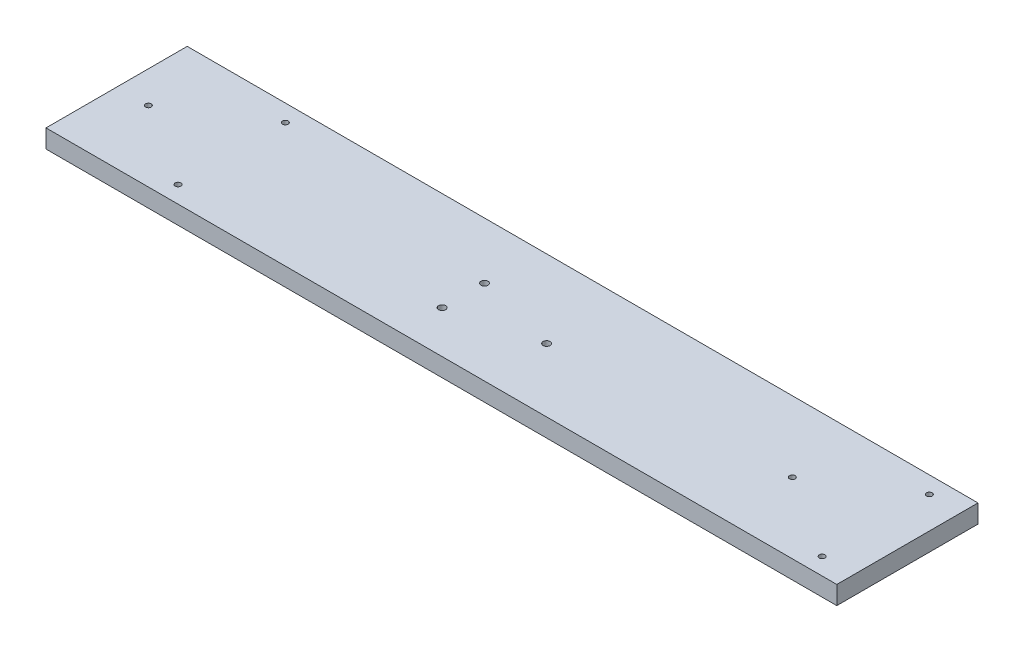
ISO-10303-21;
HEADER;
FILE_DESCRIPTION(('STEP AP214'),'2;1');
FILE_NAME('part.step','',(''),(''),'','','');
FILE_SCHEMA(('AUTOMOTIVE_DESIGN { 1 0 10303 214 1 1 1 1 }'));
ENDSEC;
DATA;
#1=APPLICATION_CONTEXT('core data for automotive mechanical design processes');
#2=APPLICATION_PROTOCOL_DEFINITION('international standard','automotive_design',2000,#1);
#3=PRODUCT_CONTEXT('',#1,'mechanical');
#4=PRODUCT('Part','Part','',(#3));
#5=PRODUCT_RELATED_PRODUCT_CATEGORY('part','',(#4));
#6=PRODUCT_DEFINITION_FORMATION('','',#4);
#7=PRODUCT_DEFINITION_CONTEXT('part definition',#1,'design');
#8=PRODUCT_DEFINITION('design','',#6,#7);
#9=PRODUCT_DEFINITION_SHAPE('','',#8);
#10=(LENGTH_UNIT() NAMED_UNIT(*) SI_UNIT(.MILLI.,.METRE.));
#11=(NAMED_UNIT(*) PLANE_ANGLE_UNIT() SI_UNIT($,.RADIAN.));
#12=(NAMED_UNIT(*) SI_UNIT($,.STERADIAN.) SOLID_ANGLE_UNIT());
#13=UNCERTAINTY_MEASURE_WITH_UNIT(LENGTH_MEASURE(1.E-05),#10,'distance_accuracy_value','');
#14=(GEOMETRIC_REPRESENTATION_CONTEXT(3) GLOBAL_UNCERTAINTY_ASSIGNED_CONTEXT((#13)) GLOBAL_UNIT_ASSIGNED_CONTEXT((#10,
#11,#12)) REPRESENTATION_CONTEXT('',''));
#15=CARTESIAN_POINT('',(0.,0.,0.));
#16=DIRECTION('',(0.,0.,1.));
#17=DIRECTION('',(1.,0.,0.));
#18=AXIS2_PLACEMENT_3D('',#15,#16,#17);
#19=CARTESIAN_POINT('',(0.,6.5,0.));
#20=DIRECTION('',(1.,0.,0.));
#21=DIRECTION('',(0.,0.,-1.));
#22=AXIS2_PLACEMENT_3D('',#19,#20,#21);
#23=PLANE('',#22);
#24=DIRECTION('',(0.,0.,1.));
#25=VECTOR('',#24,1.);
#26=CARTESIAN_POINT('',(0.,0.,0.));
#27=LINE('',#26,#25);
#28=CARTESIAN_POINT('',(0.,0.,-50.));
#29=VERTEX_POINT('',#28);
#30=CARTESIAN_POINT('',(0.,0.,0.));
#31=VERTEX_POINT('',#30);
#32=EDGE_CURVE('E96',#29,#31,#27,.T.);
#33=ORIENTED_EDGE('',*,*,#32,.T.);
#34=DIRECTION('',(0.,-1.,0.));
#35=VECTOR('',#34,1.);
#36=CARTESIAN_POINT('',(0.,6.5,0.));
#37=LINE('',#36,#35);
#38=CARTESIAN_POINT('',(0.,6.5,0.));
#39=VERTEX_POINT('',#38);
#40=EDGE_CURVE('E11',#39,#31,#37,.T.);
#41=ORIENTED_EDGE('',*,*,#40,.F.);
#42=DIRECTION('',(0.,0.,1.));
#43=VECTOR('',#42,1.);
#44=CARTESIAN_POINT('',(0.,6.5,0.));
#45=LINE('',#44,#43);
#46=CARTESIAN_POINT('',(0.,6.5,-50.));
#47=VERTEX_POINT('',#46);
#48=EDGE_CURVE('E84',#47,#39,#45,.T.);
#49=ORIENTED_EDGE('',*,*,#48,.F.);
#50=DIRECTION('',(0.,-1.,0.));
#51=VECTOR('',#50,1.);
#52=CARTESIAN_POINT('',(0.,6.5,-50.));
#53=LINE('',#52,#51);
#54=EDGE_CURVE('E92',#47,#29,#53,.T.);
#55=ORIENTED_EDGE('',*,*,#54,.T.);
#56=EDGE_LOOP('',(#33,#41,#49,#55));
#57=FACE_BOUND('',#56,.T.);
#58=ADVANCED_FACE('F33',(#57),#23,.F.);
#59=CARTESIAN_POINT('',(0.,6.5,0.));
#60=DIRECTION('',(0.,0.,-1.));
#61=DIRECTION('',(-1.,0.,0.));
#62=AXIS2_PLACEMENT_3D('',#59,#60,#61);
#63=PLANE('',#62);
#64=DIRECTION('',(1.,0.,0.));
#65=VECTOR('',#64,1.);
#66=CARTESIAN_POINT('',(0.,0.,0.));
#67=LINE('',#66,#65);
#68=CARTESIAN_POINT('',(280.,0.,0.));
#69=VERTEX_POINT('',#68);
#70=EDGE_CURVE('E88',#31,#69,#67,.T.);
#71=ORIENTED_EDGE('',*,*,#70,.T.);
#72=DIRECTION('',(0.,-1.,0.));
#73=VECTOR('',#72,1.);
#74=CARTESIAN_POINT('',(280.,6.5,0.));
#75=LINE('',#74,#73);
#76=CARTESIAN_POINT('',(280.,6.5,0.));
#77=VERTEX_POINT('',#76);
#78=EDGE_CURVE('E41',#77,#69,#75,.T.);
#79=ORIENTED_EDGE('',*,*,#78,.F.);
#80=DIRECTION('',(1.,0.,0.));
#81=VECTOR('',#80,1.);
#82=CARTESIAN_POINT('',(0.,6.5,0.));
#83=LINE('',#82,#81);
#84=EDGE_CURVE('E79',#39,#77,#83,.T.);
#85=ORIENTED_EDGE('',*,*,#84,.F.);
#86=ORIENTED_EDGE('',*,*,#40,.T.);
#87=EDGE_LOOP('',(#71,#79,#85,#86));
#88=FACE_BOUND('',#87,.T.);
#89=ADVANCED_FACE('F87',(#88),#63,.F.);
#90=CARTESIAN_POINT('',(280.,6.5,0.));
#91=DIRECTION('',(-1.,0.,0.));
#92=DIRECTION('',(0.,0.,1.));
#93=AXIS2_PLACEMENT_3D('',#90,#91,#92);
#94=PLANE('',#93);
#95=DIRECTION('',(0.,0.,-1.));
#96=VECTOR('',#95,1.);
#97=CARTESIAN_POINT('',(280.,0.,0.));
#98=LINE('',#97,#96);
#99=CARTESIAN_POINT('',(280.,0.,-50.));
#100=VERTEX_POINT('',#99);
#101=EDGE_CURVE('E66',#69,#100,#98,.T.);
#102=ORIENTED_EDGE('',*,*,#101,.T.);
#103=DIRECTION('',(0.,-1.,0.));
#104=VECTOR('',#103,1.);
#105=CARTESIAN_POINT('',(280.,6.5,-50.));
#106=LINE('',#105,#104);
#107=CARTESIAN_POINT('',(280.,6.5,-50.));
#108=VERTEX_POINT('',#107);
#109=EDGE_CURVE('E89',#108,#100,#106,.T.);
#110=ORIENTED_EDGE('',*,*,#109,.F.);
#111=DIRECTION('',(0.,0.,-1.));
#112=VECTOR('',#111,1.);
#113=CARTESIAN_POINT('',(280.,6.5,0.));
#114=LINE('',#113,#112);
#115=EDGE_CURVE('E82',#77,#108,#114,.T.);
#116=ORIENTED_EDGE('',*,*,#115,.F.);
#117=ORIENTED_EDGE('',*,*,#78,.T.);
#118=EDGE_LOOP('',(#102,#110,#116,#117));
#119=FACE_BOUND('',#118,.T.);
#120=ADVANCED_FACE('F90',(#119),#94,.F.);
#121=CARTESIAN_POINT('',(0.,6.5,-50.));
#122=DIRECTION('',(0.,0.,1.));
#123=DIRECTION('',(1.,0.,0.));
#124=AXIS2_PLACEMENT_3D('',#121,#122,#123);
#125=PLANE('',#124);
#126=DIRECTION('',(-1.,0.,0.));
#127=VECTOR('',#126,1.);
#128=CARTESIAN_POINT('',(0.,0.,-50.));
#129=LINE('',#128,#127);
#130=EDGE_CURVE('E72',#100,#29,#129,.T.);
#131=ORIENTED_EDGE('',*,*,#130,.T.);
#132=ORIENTED_EDGE('',*,*,#54,.F.);
#133=DIRECTION('',(-1.,0.,0.));
#134=VECTOR('',#133,1.);
#135=CARTESIAN_POINT('',(0.,6.5,-50.));
#136=LINE('',#135,#134);
#137=EDGE_CURVE('E49',#108,#47,#136,.T.);
#138=ORIENTED_EDGE('',*,*,#137,.F.);
#139=ORIENTED_EDGE('',*,*,#109,.T.);
#140=EDGE_LOOP('',(#131,#132,#138,#139));
#141=FACE_BOUND('',#140,.T.);
#142=ADVANCED_FACE('F104',(#141),#125,.F.);
#143=CARTESIAN_POINT('',(0.,6.5,0.));
#144=DIRECTION('',(0.,-1.,0.));
#145=DIRECTION('',(0.,0.,-1.));
#146=AXIS2_PLACEMENT_3D('',#143,#144,#145);
#147=PLANE('',#146);
#148=CARTESIAN_POINT('',(40.75,6.5,-44.));
#149=DIRECTION('',(0.,-1.,0.));
#150=DIRECTION('',(0.,0.,-1.));
#151=AXIS2_PLACEMENT_3D('',#148,#149,#150);
#152=CIRCLE('',#151,0.999999999999998);
#153=CARTESIAN_POINT('',(40.75,6.5,-45.));
#154=VERTEX_POINT('',#153);
#155=EDGE_CURVE('E155',#154,#154,#152,.T.);
#156=ORIENTED_EDGE('',*,*,#155,.T.);
#157=EDGE_LOOP('',(#156));
#158=FACE_BOUND('',#157,.T.);
#159=CARTESIAN_POINT('',(40.75,6.5,-6.));
#160=DIRECTION('',(0.,-1.,0.));
#161=DIRECTION('',(0.,0.,-1.));
#162=AXIS2_PLACEMENT_3D('',#159,#160,#161);
#163=CIRCLE('',#162,0.999999999999998);
#164=CARTESIAN_POINT('',(40.75,6.5,-7.));
#165=VERTEX_POINT('',#164);
#166=EDGE_CURVE('E149',#165,#165,#163,.T.);
#167=ORIENTED_EDGE('',*,*,#166,.T.);
#168=EDGE_LOOP('',(#167));
#169=FACE_BOUND('',#168,.T.);
#170=CARTESIAN_POINT('',(11.25,6.5,-25.));
#171=DIRECTION('',(0.,-1.,0.));
#172=DIRECTION('',(0.,0.,-1.));
#173=AXIS2_PLACEMENT_3D('',#170,#171,#172);
#174=CIRCLE('',#173,1.);
#175=CARTESIAN_POINT('',(11.25,6.5,-26.));
#176=VERTEX_POINT('',#175);
#177=EDGE_CURVE('E143',#176,#176,#174,.T.);
#178=ORIENTED_EDGE('',*,*,#177,.T.);
#179=EDGE_LOOP('',(#178));
#180=FACE_BOUND('',#179,.T.);
#181=CARTESIAN_POINT('',(239.25,6.5,-25.));
#182=DIRECTION('',(0.,-1.,0.));
#183=DIRECTION('',(0.,0.,-1.));
#184=AXIS2_PLACEMENT_3D('',#181,#182,#183);
#185=CIRCLE('',#184,0.999999999999998);
#186=CARTESIAN_POINT('',(239.25,6.5,-26.));
#187=VERTEX_POINT('',#186);
#188=EDGE_CURVE('E137',#187,#187,#185,.T.);
#189=ORIENTED_EDGE('',*,*,#188,.T.);
#190=EDGE_LOOP('',(#189));
#191=FACE_BOUND('',#190,.T.);
#192=CARTESIAN_POINT('',(268.7984697132,6.5,-6.));
#193=DIRECTION('',(0.,-1.,0.));
#194=DIRECTION('',(0.,0.,-1.));
#195=AXIS2_PLACEMENT_3D('',#192,#193,#194);
#196=CIRCLE('',#195,0.999999999999998);
#197=CARTESIAN_POINT('',(268.7984697132,6.5,-7.));
#198=VERTEX_POINT('',#197);
#199=EDGE_CURVE('E131',#198,#198,#196,.T.);
#200=ORIENTED_EDGE('',*,*,#199,.T.);
#201=EDGE_LOOP('',(#200));
#202=FACE_BOUND('',#201,.T.);
#203=CARTESIAN_POINT('',(268.7984697132,6.5,-44.));
#204=DIRECTION('',(0.,-1.,0.));
#205=DIRECTION('',(0.,0.,-1.));
#206=AXIS2_PLACEMENT_3D('',#203,#204,#205);
#207=CIRCLE('',#206,0.999999999999998);
#208=CARTESIAN_POINT('',(268.7984697132,6.5,-45.));
#209=VERTEX_POINT('',#208);
#210=EDGE_CURVE('E125',#209,#209,#207,.T.);
#211=ORIENTED_EDGE('',*,*,#210,.T.);
#212=EDGE_LOOP('',(#211));
#213=FACE_BOUND('',#212,.T.);
#214=CARTESIAN_POINT('',(154.75,6.5,-22.5));
#215=DIRECTION('',(0.,-1.,0.));
#216=DIRECTION('',(0.,0.,-1.));
#217=AXIS2_PLACEMENT_3D('',#214,#215,#216);
#218=CIRCLE('',#217,1.25000000000001);
#219=CARTESIAN_POINT('',(154.75,6.5,-23.75));
#220=VERTEX_POINT('',#219);
#221=EDGE_CURVE('E119',#220,#220,#218,.T.);
#222=ORIENTED_EDGE('',*,*,#221,.T.);
#223=EDGE_LOOP('',(#222));
#224=FACE_BOUND('',#223,.T.);
#225=CARTESIAN_POINT('',(125.25,6.5,-15.));
#226=DIRECTION('',(0.,-1.,0.));
#227=DIRECTION('',(0.,0.,-1.));
#228=AXIS2_PLACEMENT_3D('',#225,#226,#227);
#229=CIRCLE('',#228,1.25);
#230=CARTESIAN_POINT('',(125.25,6.5,-16.25));
#231=VERTEX_POINT('',#230);
#232=EDGE_CURVE('E113',#231,#231,#229,.T.);
#233=ORIENTED_EDGE('',*,*,#232,.T.);
#234=EDGE_LOOP('',(#233));
#235=FACE_BOUND('',#234,.T.);
#236=CARTESIAN_POINT('',(125.25,6.5,-30.));
#237=DIRECTION('',(0.,-1.,0.));
#238=DIRECTION('',(0.,0.,-1.));
#239=AXIS2_PLACEMENT_3D('',#236,#237,#238);
#240=CIRCLE('',#239,1.25000000000001);
#241=CARTESIAN_POINT('',(125.25,6.5,-31.25));
#242=VERTEX_POINT('',#241);
#243=EDGE_CURVE('E99',#242,#242,#240,.T.);
#244=ORIENTED_EDGE('',*,*,#243,.T.);
#245=EDGE_LOOP('',(#244));
#246=FACE_BOUND('',#245,.T.);
#247=ORIENTED_EDGE('',*,*,#48,.T.);
#248=ORIENTED_EDGE('',*,*,#84,.T.);
#249=ORIENTED_EDGE('',*,*,#115,.T.);
#250=ORIENTED_EDGE('',*,*,#137,.T.);
#251=EDGE_LOOP('',(#247,#248,#249,#250));
#252=FACE_BOUND('',#251,.T.);
#253=ADVANCED_FACE('F80',(#158,#169,#180,#191,#202,#213,#224,#235,#246,#252),#147,.F.);
#254=CARTESIAN_POINT('',(0.,0.,0.));
#255=DIRECTION('',(0.,-1.,0.));
#256=DIRECTION('',(0.,0.,-1.));
#257=AXIS2_PLACEMENT_3D('',#254,#255,#256);
#258=PLANE('',#257);
#259=CARTESIAN_POINT('',(40.75,0.,-44.));
#260=DIRECTION('',(0.,-1.,0.));
#261=DIRECTION('',(0.,0.,-1.));
#262=AXIS2_PLACEMENT_3D('',#259,#260,#261);
#263=CIRCLE('',#262,0.999999999999998);
#264=CARTESIAN_POINT('',(40.75,0.,-45.));
#265=VERTEX_POINT('',#264);
#266=EDGE_CURVE('E158',#265,#265,#263,.T.);
#267=ORIENTED_EDGE('',*,*,#266,.F.);
#268=EDGE_LOOP('',(#267));
#269=FACE_BOUND('',#268,.T.);
#270=CARTESIAN_POINT('',(40.75,0.,-6.));
#271=DIRECTION('',(0.,-1.,0.));
#272=DIRECTION('',(0.,0.,-1.));
#273=AXIS2_PLACEMENT_3D('',#270,#271,#272);
#274=CIRCLE('',#273,0.999999999999998);
#275=CARTESIAN_POINT('',(40.75,0.,-7.));
#276=VERTEX_POINT('',#275);
#277=EDGE_CURVE('E152',#276,#276,#274,.T.);
#278=ORIENTED_EDGE('',*,*,#277,.F.);
#279=EDGE_LOOP('',(#278));
#280=FACE_BOUND('',#279,.T.);
#281=CARTESIAN_POINT('',(11.25,0.,-25.));
#282=DIRECTION('',(0.,-1.,0.));
#283=DIRECTION('',(0.,0.,-1.));
#284=AXIS2_PLACEMENT_3D('',#281,#282,#283);
#285=CIRCLE('',#284,1.);
#286=CARTESIAN_POINT('',(11.25,0.,-26.));
#287=VERTEX_POINT('',#286);
#288=EDGE_CURVE('E146',#287,#287,#285,.T.);
#289=ORIENTED_EDGE('',*,*,#288,.F.);
#290=EDGE_LOOP('',(#289));
#291=FACE_BOUND('',#290,.T.);
#292=CARTESIAN_POINT('',(239.25,0.,-25.));
#293=DIRECTION('',(0.,-1.,0.));
#294=DIRECTION('',(0.,0.,-1.));
#295=AXIS2_PLACEMENT_3D('',#292,#293,#294);
#296=CIRCLE('',#295,0.999999999999998);
#297=CARTESIAN_POINT('',(239.25,0.,-26.));
#298=VERTEX_POINT('',#297);
#299=EDGE_CURVE('E140',#298,#298,#296,.T.);
#300=ORIENTED_EDGE('',*,*,#299,.F.);
#301=EDGE_LOOP('',(#300));
#302=FACE_BOUND('',#301,.T.);
#303=CARTESIAN_POINT('',(268.7984697132,0.,-6.));
#304=DIRECTION('',(0.,-1.,0.));
#305=DIRECTION('',(0.,0.,-1.));
#306=AXIS2_PLACEMENT_3D('',#303,#304,#305);
#307=CIRCLE('',#306,0.999999999999998);
#308=CARTESIAN_POINT('',(268.7984697132,0.,-7.));
#309=VERTEX_POINT('',#308);
#310=EDGE_CURVE('E134',#309,#309,#307,.T.);
#311=ORIENTED_EDGE('',*,*,#310,.F.);
#312=EDGE_LOOP('',(#311));
#313=FACE_BOUND('',#312,.T.);
#314=CARTESIAN_POINT('',(268.7984697132,0.,-44.));
#315=DIRECTION('',(0.,-1.,0.));
#316=DIRECTION('',(0.,0.,-1.));
#317=AXIS2_PLACEMENT_3D('',#314,#315,#316);
#318=CIRCLE('',#317,0.999999999999998);
#319=CARTESIAN_POINT('',(268.7984697132,0.,-45.));
#320=VERTEX_POINT('',#319);
#321=EDGE_CURVE('E128',#320,#320,#318,.T.);
#322=ORIENTED_EDGE('',*,*,#321,.F.);
#323=EDGE_LOOP('',(#322));
#324=FACE_BOUND('',#323,.T.);
#325=CARTESIAN_POINT('',(154.75,0.,-22.5));
#326=DIRECTION('',(0.,-1.,0.));
#327=DIRECTION('',(0.,0.,-1.));
#328=AXIS2_PLACEMENT_3D('',#325,#326,#327);
#329=CIRCLE('',#328,1.25000000000001);
#330=CARTESIAN_POINT('',(154.75,0.,-23.75));
#331=VERTEX_POINT('',#330);
#332=EDGE_CURVE('E122',#331,#331,#329,.T.);
#333=ORIENTED_EDGE('',*,*,#332,.F.);
#334=EDGE_LOOP('',(#333));
#335=FACE_BOUND('',#334,.T.);
#336=CARTESIAN_POINT('',(125.25,0.,-15.));
#337=DIRECTION('',(0.,-1.,0.));
#338=DIRECTION('',(0.,0.,-1.));
#339=AXIS2_PLACEMENT_3D('',#336,#337,#338);
#340=CIRCLE('',#339,1.25);
#341=CARTESIAN_POINT('',(125.25,0.,-16.25));
#342=VERTEX_POINT('',#341);
#343=EDGE_CURVE('E116',#342,#342,#340,.T.);
#344=ORIENTED_EDGE('',*,*,#343,.F.);
#345=EDGE_LOOP('',(#344));
#346=FACE_BOUND('',#345,.T.);
#347=CARTESIAN_POINT('',(125.25,0.,-30.));
#348=DIRECTION('',(0.,-1.,0.));
#349=DIRECTION('',(0.,0.,-1.));
#350=AXIS2_PLACEMENT_3D('',#347,#348,#349);
#351=CIRCLE('',#350,1.25000000000001);
#352=CARTESIAN_POINT('',(125.25,0.,-31.25));
#353=VERTEX_POINT('',#352);
#354=EDGE_CURVE('E110',#353,#353,#351,.T.);
#355=ORIENTED_EDGE('',*,*,#354,.F.);
#356=EDGE_LOOP('',(#355));
#357=FACE_BOUND('',#356,.T.);
#358=ORIENTED_EDGE('',*,*,#32,.F.);
#359=ORIENTED_EDGE('',*,*,#130,.F.);
#360=ORIENTED_EDGE('',*,*,#101,.F.);
#361=ORIENTED_EDGE('',*,*,#70,.F.);
#362=EDGE_LOOP('',(#358,#359,#360,#361));
#363=FACE_BOUND('',#362,.T.);
#364=ADVANCED_FACE('F107',(#269,#280,#291,#302,#313,#324,#335,#346,#357,#363),#258,.T.);
#365=CARTESIAN_POINT('',(125.25,6.5,-30.));
#366=DIRECTION('',(0.,-1.,0.));
#367=DIRECTION('',(0.,0.,-1.));
#368=AXIS2_PLACEMENT_3D('',#365,#366,#367);
#369=CYLINDRICAL_SURFACE('',#368,1.25000000000001);
#370=ORIENTED_EDGE('',*,*,#243,.F.);
#371=EDGE_LOOP('',(#370));
#372=FACE_BOUND('',#371,.T.);
#373=ORIENTED_EDGE('',*,*,#354,.T.);
#374=EDGE_LOOP('',(#373));
#375=FACE_BOUND('',#374,.T.);
#376=ADVANCED_FACE('F175',(#372,#375),#369,.F.);
#377=CARTESIAN_POINT('',(125.25,6.5,-15.));
#378=DIRECTION('',(0.,-1.,0.));
#379=DIRECTION('',(0.,0.,-1.));
#380=AXIS2_PLACEMENT_3D('',#377,#378,#379);
#381=CYLINDRICAL_SURFACE('',#380,1.25);
#382=ORIENTED_EDGE('',*,*,#232,.F.);
#383=EDGE_LOOP('',(#382));
#384=FACE_BOUND('',#383,.T.);
#385=ORIENTED_EDGE('',*,*,#343,.T.);
#386=EDGE_LOOP('',(#385));
#387=FACE_BOUND('',#386,.T.);
#388=ADVANCED_FACE('F194',(#384,#387),#381,.F.);
#389=CARTESIAN_POINT('',(154.75,6.5,-22.5));
#390=DIRECTION('',(0.,-1.,0.));
#391=DIRECTION('',(0.,0.,-1.));
#392=AXIS2_PLACEMENT_3D('',#389,#390,#391);
#393=CYLINDRICAL_SURFACE('',#392,1.25000000000001);
#394=ORIENTED_EDGE('',*,*,#221,.F.);
#395=EDGE_LOOP('',(#394));
#396=FACE_BOUND('',#395,.T.);
#397=ORIENTED_EDGE('',*,*,#332,.T.);
#398=EDGE_LOOP('',(#397));
#399=FACE_BOUND('',#398,.T.);
#400=ADVANCED_FACE('F200',(#396,#399),#393,.F.);
#401=CARTESIAN_POINT('',(268.7984697132,6.5,-44.));
#402=DIRECTION('',(0.,-1.,0.));
#403=DIRECTION('',(0.,0.,-1.));
#404=AXIS2_PLACEMENT_3D('',#401,#402,#403);
#405=CYLINDRICAL_SURFACE('',#404,0.999999999999998);
#406=ORIENTED_EDGE('',*,*,#210,.F.);
#407=EDGE_LOOP('',(#406));
#408=FACE_BOUND('',#407,.T.);
#409=ORIENTED_EDGE('',*,*,#321,.T.);
#410=EDGE_LOOP('',(#409));
#411=FACE_BOUND('',#410,.T.);
#412=ADVANCED_FACE('F231',(#408,#411),#405,.F.);
#413=CARTESIAN_POINT('',(268.7984697132,6.5,-6.));
#414=DIRECTION('',(0.,-1.,0.));
#415=DIRECTION('',(0.,0.,-1.));
#416=AXIS2_PLACEMENT_3D('',#413,#414,#415);
#417=CYLINDRICAL_SURFACE('',#416,0.999999999999998);
#418=ORIENTED_EDGE('',*,*,#199,.F.);
#419=EDGE_LOOP('',(#418));
#420=FACE_BOUND('',#419,.T.);
#421=ORIENTED_EDGE('',*,*,#310,.T.);
#422=EDGE_LOOP('',(#421));
#423=FACE_BOUND('',#422,.T.);
#424=ADVANCED_FACE('F236',(#420,#423),#417,.F.);
#425=CARTESIAN_POINT('',(239.25,6.5,-25.));
#426=DIRECTION('',(0.,-1.,0.));
#427=DIRECTION('',(0.,0.,-1.));
#428=AXIS2_PLACEMENT_3D('',#425,#426,#427);
#429=CYLINDRICAL_SURFACE('',#428,0.999999999999998);
#430=ORIENTED_EDGE('',*,*,#188,.F.);
#431=EDGE_LOOP('',(#430));
#432=FACE_BOUND('',#431,.T.);
#433=ORIENTED_EDGE('',*,*,#299,.T.);
#434=EDGE_LOOP('',(#433));
#435=FACE_BOUND('',#434,.T.);
#436=ADVANCED_FACE('F248',(#432,#435),#429,.F.);
#437=CARTESIAN_POINT('',(11.25,6.5,-25.));
#438=DIRECTION('',(0.,-1.,0.));
#439=DIRECTION('',(0.,0.,-1.));
#440=AXIS2_PLACEMENT_3D('',#437,#438,#439);
#441=CYLINDRICAL_SURFACE('',#440,1.);
#442=ORIENTED_EDGE('',*,*,#177,.F.);
#443=EDGE_LOOP('',(#442));
#444=FACE_BOUND('',#443,.T.);
#445=ORIENTED_EDGE('',*,*,#288,.T.);
#446=EDGE_LOOP('',(#445));
#447=FACE_BOUND('',#446,.T.);
#448=ADVANCED_FACE('F258',(#444,#447),#441,.F.);
#449=CARTESIAN_POINT('',(40.75,6.5,-6.));
#450=DIRECTION('',(0.,-1.,0.));
#451=DIRECTION('',(0.,0.,-1.));
#452=AXIS2_PLACEMENT_3D('',#449,#450,#451);
#453=CYLINDRICAL_SURFACE('',#452,0.999999999999998);
#454=ORIENTED_EDGE('',*,*,#166,.F.);
#455=EDGE_LOOP('',(#454));
#456=FACE_BOUND('',#455,.T.);
#457=ORIENTED_EDGE('',*,*,#277,.T.);
#458=EDGE_LOOP('',(#457));
#459=FACE_BOUND('',#458,.T.);
#460=ADVANCED_FACE('F169',(#456,#459),#453,.F.);
#461=CARTESIAN_POINT('',(40.75,6.5,-44.));
#462=DIRECTION('',(0.,-1.,0.));
#463=DIRECTION('',(0.,0.,-1.));
#464=AXIS2_PLACEMENT_3D('',#461,#462,#463);
#465=CYLINDRICAL_SURFACE('',#464,0.999999999999998);
#466=ORIENTED_EDGE('',*,*,#155,.F.);
#467=EDGE_LOOP('',(#466));
#468=FACE_BOUND('',#467,.T.);
#469=ORIENTED_EDGE('',*,*,#266,.T.);
#470=EDGE_LOOP('',(#469));
#471=FACE_BOUND('',#470,.T.);
#472=ADVANCED_FACE('F166',(#468,#471),#465,.F.);
#473=CLOSED_SHELL('',(#58,#89,#120,#142,#253,#364,#376,#388,#400,#412,#424,#436,#448,#460,#472));
#474=MANIFOLD_SOLID_BREP('B2',#473);
#475=ADVANCED_BREP_SHAPE_REPRESENTATION('',(#18,#474),#14);
#476=SHAPE_DEFINITION_REPRESENTATION(#9,#475);
ENDSEC;
END-ISO-10303-21;
